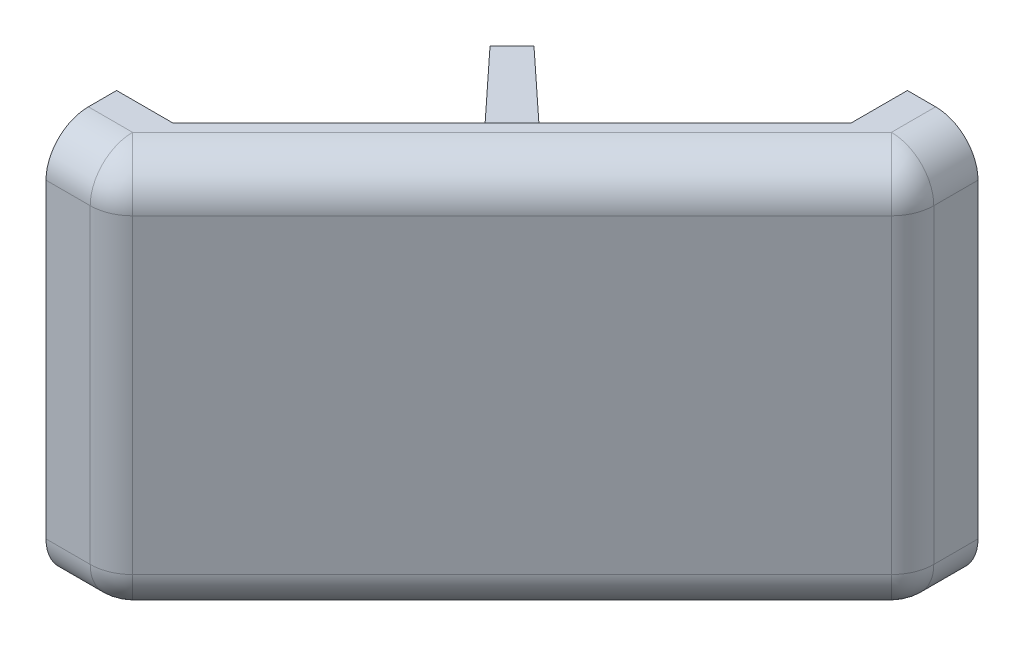
ISO-10303-21;
HEADER;
FILE_DESCRIPTION(('STEP AP214'),'2;1');
FILE_NAME('part.step','',(''),(''),'','','');
FILE_SCHEMA(('AUTOMOTIVE_DESIGN { 1 0 10303 214 1 1 1 1 }'));
ENDSEC;
DATA;
#1=APPLICATION_CONTEXT('core data for automotive mechanical design processes');
#2=APPLICATION_PROTOCOL_DEFINITION('international standard','automotive_design',2000,#1);
#3=PRODUCT_CONTEXT('',#1,'mechanical');
#4=PRODUCT('Part','Part','',(#3));
#5=PRODUCT_RELATED_PRODUCT_CATEGORY('part','',(#4));
#6=PRODUCT_DEFINITION_FORMATION('','',#4);
#7=PRODUCT_DEFINITION_CONTEXT('part definition',#1,'design');
#8=PRODUCT_DEFINITION('design','',#6,#7);
#9=PRODUCT_DEFINITION_SHAPE('','',#8);
#10=(LENGTH_UNIT() NAMED_UNIT(*) SI_UNIT(.MILLI.,.METRE.));
#11=(NAMED_UNIT(*) PLANE_ANGLE_UNIT() SI_UNIT($,.RADIAN.));
#12=(NAMED_UNIT(*) SI_UNIT($,.STERADIAN.) SOLID_ANGLE_UNIT());
#13=UNCERTAINTY_MEASURE_WITH_UNIT(LENGTH_MEASURE(1.E-05),#10,'distance_accuracy_value','');
#14=(GEOMETRIC_REPRESENTATION_CONTEXT(3) GLOBAL_UNCERTAINTY_ASSIGNED_CONTEXT((#13)) GLOBAL_UNIT_ASSIGNED_CONTEXT((#10,
#11,#12)) REPRESENTATION_CONTEXT('',''));
#15=CARTESIAN_POINT('',(0.,0.,0.));
#16=DIRECTION('',(0.,0.,1.));
#17=DIRECTION('',(1.,0.,0.));
#18=AXIS2_PLACEMENT_3D('',#15,#16,#17);
#19=CARTESIAN_POINT('',(-15.889087296526,9.25000000000002,12.110912703474));
#20=DIRECTION('',(0.426160307303989,-0.797981694625345,0.426160307303992));
#21=DIRECTION('',(0.,-0.47107876930948,-0.882091147844635));
#22=AXIS2_PLACEMENT_3D('',#19,#20,#21);
#23=PLANE('',#22);
#24=DIRECTION('',(-0.54434262878189,-0.602447824890011,-0.583736002638279));
#25=VECTOR('',#24,1.);
#26=CARTESIAN_POINT('',(-12.8461130269805,13.6022358518807,17.2174645182889));
#27=LINE('',#26,#25);
#28=CARTESIAN_POINT('',(-16.7785822082313,9.25000000000002,13.0004076151792));
#29=VERTEX_POINT('',#28);
#30=CARTESIAN_POINT('',(-19.8494455154673,5.85134109996337,9.70730989173632));
#31=VERTEX_POINT('',#30);
#32=EDGE_CURVE('E34',#29,#31,#27,.T.);
#33=ORIENTED_EDGE('',*,*,#32,.F.);
#34=DIRECTION('',(-0.707106781186548,0.,0.707106781186548));
#35=VECTOR('',#34,1.);
#36=CARTESIAN_POINT('',(-15.889087296526,9.25000000000002,12.110912703474));
#37=LINE('',#36,#35);
#38=CARTESIAN_POINT('',(-14.9995923848208,9.25000000000002,11.2214177917687));
#39=VERTEX_POINT('',#38);
#40=EDGE_CURVE('E25',#39,#29,#37,.T.);
#41=ORIENTED_EDGE('',*,*,#40,.F.);
#42=DIRECTION('',(0.583736002638279,0.602447824890011,0.544342628781889));
#43=VECTOR('',#42,1.);
#44=CARTESIAN_POINT('',(-15.0025813029042,9.24691527130424,11.2186305805648));
#45=LINE('',#44,#43);
#46=CARTESIAN_POINT('',(-18.2926901082637,5.85134109996337,8.15055448453267));
#47=VERTEX_POINT('',#46);
#48=EDGE_CURVE('E456',#47,#39,#45,.T.);
#49=ORIENTED_EDGE('',*,*,#48,.F.);
#50=DIRECTION('',(0.707106781186547,0.,-0.707106781186548));
#51=VECTOR('',#50,1.);
#52=CARTESIAN_POINT('',(-19.0710678118655,5.85134109996337,8.92893218813449));
#53=LINE('',#52,#51);
#54=EDGE_CURVE('E418',#31,#47,#53,.T.);
#55=ORIENTED_EDGE('',*,*,#54,.F.);
#56=EDGE_LOOP('',(#33,#41,#49,#55));
#57=FACE_BOUND('',#56,.T.);
#58=ADVANCED_FACE('F15',(#57),#23,.F.);
#59=CARTESIAN_POINT('',(-19.0710678118655,22.1486589000367,8.92893218813448));
#60=DIRECTION('',(0.426160307303993,0.797981694625344,0.42616030730399));
#61=DIRECTION('',(-0.882091147844634,0.471078769309481,0.));
#62=AXIS2_PLACEMENT_3D('',#59,#60,#61);
#63=PLANE('',#62);
#64=DIRECTION('',(0.544342628781888,-0.602447824890012,0.58373600263828));
#65=VECTOR('',#64,1.);
#66=CARTESIAN_POINT('',(-18.3156097025339,20.4510956367883,11.3521474238414));
#67=LINE('',#66,#65);
#68=CARTESIAN_POINT('',(-19.8494455154673,22.1486589000367,9.7073098917363));
#69=VERTEX_POINT('',#68);
#70=CARTESIAN_POINT('',(-16.7785822082313,18.75,13.0004076151792));
#71=VERTEX_POINT('',#70);
#72=EDGE_CURVE('E452',#69,#71,#67,.T.);
#73=ORIENTED_EDGE('',*,*,#72,.F.);
#74=DIRECTION('',(-0.707106781186547,0.,0.707106781186548));
#75=VECTOR('',#74,1.);
#76=CARTESIAN_POINT('',(-19.0710678118655,22.1486589000367,8.92893218813448));
#77=LINE('',#76,#75);
#78=CARTESIAN_POINT('',(-18.2926901082637,22.1486589000367,8.15055448453266));
#79=VERTEX_POINT('',#78);
#80=EDGE_CURVE('E459',#79,#69,#77,.T.);
#81=ORIENTED_EDGE('',*,*,#80,.F.);
#82=DIRECTION('',(-0.583736002638278,0.602447824890012,-0.544342628781889));
#83=VECTOR('',#82,1.);
#84=CARTESIAN_POINT('',(-12.4278067549655,16.0957750562119,13.6196466899208));
#85=LINE('',#84,#83);
#86=CARTESIAN_POINT('',(-14.9995923848208,18.75,11.2214177917687));
#87=VERTEX_POINT('',#86);
#88=EDGE_CURVE('E425',#87,#79,#85,.T.);
#89=ORIENTED_EDGE('',*,*,#88,.F.);
#90=DIRECTION('',(-0.707106781186548,0.,0.707106781186548));
#91=VECTOR('',#90,1.);
#92=CARTESIAN_POINT('',(-15.889087296526,18.75,12.110912703474));
#93=LINE('',#92,#91);
#94=EDGE_CURVE('E9',#87,#71,#93,.T.);
#95=ORIENTED_EDGE('',*,*,#94,.T.);
#96=EDGE_LOOP('',(#73,#81,#89,#95));
#97=FACE_BOUND('',#96,.T.);
#98=ADVANCED_FACE('F369',(#97),#63,.F.);
#99=CARTESIAN_POINT('',(-15.889087296526,18.75,12.110912703474));
#100=DIRECTION('',(0.707106781186548,0.,0.707106781186548));
#101=DIRECTION('',(0.707106781186548,0.,-0.707106781186548));
#102=AXIS2_PLACEMENT_3D('',#99,#100,#101);
#103=PLANE('',#102);
#104=DIRECTION('',(0.,-1.,0.));
#105=VECTOR('',#104,1.);
#106=CARTESIAN_POINT('',(-16.7785822082312,22.375,13.0004076151792));
#107=LINE('',#106,#105);
#108=EDGE_CURVE('E413',#71,#29,#107,.T.);
#109=ORIENTED_EDGE('',*,*,#108,.F.);
#110=ORIENTED_EDGE('',*,*,#94,.F.);
#111=DIRECTION('',(0.,1.,0.));
#112=VECTOR('',#111,1.);
#113=CARTESIAN_POINT('',(-14.9995923848208,10.375,11.2214177917687));
#114=LINE('',#113,#112);
#115=EDGE_CURVE('E453',#39,#87,#114,.T.);
#116=ORIENTED_EDGE('',*,*,#115,.F.);
#117=ORIENTED_EDGE('',*,*,#40,.T.);
#118=EDGE_LOOP('',(#109,#110,#116,#117));
#119=FACE_BOUND('',#118,.T.);
#120=ADVANCED_FACE('F374',(#119),#103,.F.);
#121=CARTESIAN_POINT('',(-19.0710678118655,14.,8.92893218813449));
#122=DIRECTION('',(0.707106781186548,0.,0.707106781186547));
#123=DIRECTION('',(0.707106781186547,0.,-0.707106781186548));
#124=AXIS2_PLACEMENT_3D('',#121,#122,#123);
#125=PLANE('',#124);
#126=ORIENTED_EDGE('',*,*,#80,.T.);
#127=DIRECTION('',(0.,-1.,0.));
#128=VECTOR('',#127,1.);
#129=CARTESIAN_POINT('',(-19.8494455154673,26.,9.7073098917363));
#130=LINE('',#129,#128);
#131=CARTESIAN_POINT('',(-19.8494455154673,25.6507923050826,9.7073098917363));
#132=VERTEX_POINT('',#131);
#133=EDGE_CURVE('E439',#132,#69,#130,.T.);
#134=ORIENTED_EDGE('',*,*,#133,.F.);
#135=DIRECTION('',(-0.707106781186548,0.,0.707106781186547));
#136=VECTOR('',#135,1.);
#137=CARTESIAN_POINT('',(-18.045762979145,25.6507923050826,7.903627355414));
#138=LINE('',#137,#136);
#139=CARTESIAN_POINT('',(-18.2926901082637,25.6507923050826,8.15055448453266));
#140=VERTEX_POINT('',#139);
#141=EDGE_CURVE('E431',#140,#132,#138,.T.);
#142=ORIENTED_EDGE('',*,*,#141,.F.);
#143=DIRECTION('',(0.,1.,0.));
#144=VECTOR('',#143,1.);
#145=CARTESIAN_POINT('',(-18.2926901082637,2.00000000000002,8.15055448453267));
#146=LINE('',#145,#144);
#147=EDGE_CURVE('E422',#79,#140,#146,.T.);
#148=ORIENTED_EDGE('',*,*,#147,.F.);
#149=EDGE_LOOP('',(#126,#134,#142,#148));
#150=FACE_BOUND('',#149,.T.);
#151=ADVANCED_FACE('F380',(#150),#125,.F.);
#152=CARTESIAN_POINT('',(-19.0710678118655,14.,8.92893218813449));
#153=DIRECTION('',(0.707106781186548,0.,0.707106781186547));
#154=DIRECTION('',(0.707106781186547,0.,-0.707106781186548));
#155=AXIS2_PLACEMENT_3D('',#152,#153,#154);
#156=PLANE('',#155);
#157=ORIENTED_EDGE('',*,*,#54,.T.);
#158=DIRECTION('',(0.,1.,0.));
#159=VECTOR('',#158,1.);
#160=CARTESIAN_POINT('',(-18.2926901082637,2.00000000000002,8.15055448453267));
#161=LINE('',#160,#159);
#162=CARTESIAN_POINT('',(-18.2926901082637,2.3492076949175,8.15055448453267));
#163=VERTEX_POINT('',#162);
#164=EDGE_CURVE('E417',#163,#47,#161,.T.);
#165=ORIENTED_EDGE('',*,*,#164,.F.);
#166=DIRECTION('',(0.707106781186548,0.,-0.707106781186547));
#167=VECTOR('',#166,1.);
#168=CARTESIAN_POINT('',(-20.096372644586,2.3492076949175,9.954237020855));
#169=LINE('',#168,#167);
#170=CARTESIAN_POINT('',(-19.8494455154673,2.3492076949175,9.70730989173632));
#171=VERTEX_POINT('',#170);
#172=EDGE_CURVE('E403',#171,#163,#169,.T.);
#173=ORIENTED_EDGE('',*,*,#172,.F.);
#174=DIRECTION('',(0.,-1.,0.));
#175=VECTOR('',#174,1.);
#176=CARTESIAN_POINT('',(-19.8494455154673,26.,9.7073098917363));
#177=LINE('',#176,#175);
#178=EDGE_CURVE('E438',#31,#171,#177,.T.);
#179=ORIENTED_EDGE('',*,*,#178,.F.);
#180=EDGE_LOOP('',(#157,#165,#173,#179));
#181=FACE_BOUND('',#180,.T.);
#182=ADVANCED_FACE('F384',(#181),#156,.F.);
#183=CARTESIAN_POINT('',(-10.9746951672795,2.00000000000001,14.9746951672795));
#184=DIRECTION('',(0.681998360062499,0.,-0.73135370161917));
#185=DIRECTION('',(-0.73135370161917,0.,-0.681998360062499));
#186=AXIS2_PLACEMENT_3D('',#183,#184,#185);
#187=PLANE('',#186);
#188=ORIENTED_EDGE('',*,*,#48,.T.);
#189=ORIENTED_EDGE('',*,*,#115,.T.);
#190=ORIENTED_EDGE('',*,*,#88,.T.);
#191=ORIENTED_EDGE('',*,*,#147,.T.);
#192=DIRECTION('',(-0.730908722842805,-0.0348782627423742,-0.681583410640527));
#193=VECTOR('',#192,1.);
#194=CARTESIAN_POINT('',(-11.2806090849916,25.9854020814569,14.6894258239535));
#195=LINE('',#194,#193);
#196=CARTESIAN_POINT('',(-10.9746951672795,26.,14.9746951672795));
#197=VERTEX_POINT('',#196);
#198=EDGE_CURVE('E434',#197,#140,#195,.T.);
#199=ORIENTED_EDGE('',*,*,#198,.F.);
#200=DIRECTION('',(0.,1.,0.));
#201=VECTOR('',#200,1.);
#202=CARTESIAN_POINT('',(-10.9746951672795,1.00000000000001,14.9746951672795));
#203=LINE('',#202,#201);
#204=CARTESIAN_POINT('',(-10.9746951672795,2.00000000000001,14.9746951672795));
#205=VERTEX_POINT('',#204);
#206=EDGE_CURVE('E421',#205,#197,#203,.T.);
#207=ORIENTED_EDGE('',*,*,#206,.F.);
#208=DIRECTION('',(-0.730908722842805,0.0348782627423751,-0.681583410640527));
#209=VECTOR('',#208,1.);
#210=CARTESIAN_POINT('',(-11.0116597656697,2.00176391515731,14.9402251216276));
#211=LINE('',#210,#209);
#212=EDGE_CURVE('E407',#205,#163,#211,.T.);
#213=ORIENTED_EDGE('',*,*,#212,.T.);
#214=ORIENTED_EDGE('',*,*,#164,.T.);
#215=EDGE_LOOP('',(#188,#189,#190,#191,#199,#207,#213,#214));
#216=FACE_BOUND('',#215,.T.);
#217=ADVANCED_FACE('F388',(#216),#187,.T.);
#218=CARTESIAN_POINT('',(-13.0253048327205,26.,17.0253048327205));
#219=DIRECTION('',(-0.731353701619171,0.,0.681998360062498));
#220=DIRECTION('',(0.681998360062498,0.,0.731353701619171));
#221=AXIS2_PLACEMENT_3D('',#218,#219,#220);
#222=PLANE('',#221);
#223=ORIENTED_EDGE('',*,*,#32,.T.);
#224=ORIENTED_EDGE('',*,*,#178,.T.);
#225=DIRECTION('',(-0.681583410640527,0.034878262742375,-0.730908722842806));
#226=VECTOR('',#225,1.);
#227=CARTESIAN_POINT('',(-13.3105741760465,2.01459791854313,16.7193909150084));
#228=LINE('',#227,#226);
#229=CARTESIAN_POINT('',(-13.0253048327205,2.00000000000002,17.0253048327205));
#230=VERTEX_POINT('',#229);
#231=EDGE_CURVE('E410',#230,#171,#228,.T.);
#232=ORIENTED_EDGE('',*,*,#231,.F.);
#233=DIRECTION('',(0.,-1.,0.));
#234=VECTOR('',#233,1.);
#235=CARTESIAN_POINT('',(-13.0253048327205,13.,17.0253048327205));
#236=LINE('',#235,#234);
#237=CARTESIAN_POINT('',(-13.0253048327205,26.,17.0253048327205));
#238=VERTEX_POINT('',#237);
#239=EDGE_CURVE('E432',#238,#230,#236,.T.);
#240=ORIENTED_EDGE('',*,*,#239,.F.);
#241=DIRECTION('',(-0.681583410640527,-0.0348782627423743,-0.730908722842806));
#242=VECTOR('',#241,1.);
#243=CARTESIAN_POINT('',(-13.0597748783724,25.9982360848427,16.9883402343302));
#244=LINE('',#243,#242);
#245=EDGE_CURVE('E436',#238,#132,#244,.T.);
#246=ORIENTED_EDGE('',*,*,#245,.T.);
#247=ORIENTED_EDGE('',*,*,#133,.T.);
#248=ORIENTED_EDGE('',*,*,#72,.T.);
#249=ORIENTED_EDGE('',*,*,#108,.T.);
#250=EDGE_LOOP('',(#223,#224,#232,#240,#246,#247,#248,#249));
#251=FACE_BOUND('',#250,.T.);
#252=ADVANCED_FACE('F392',(#251),#222,.T.);
#253=CARTESIAN_POINT('',(-13.0253048327205,2.00000000000002,17.0253048327205));
#254=DIRECTION('',(-0.0246776707783373,-0.999390827019096,-0.0246776707783353));
#255=DIRECTION('',(0.999695274307761,-0.0246851884078331,0.));
#256=AXIS2_PLACEMENT_3D('',#253,#254,#255);
#257=PLANE('',#256);
#258=ORIENTED_EDGE('',*,*,#172,.T.);
#259=ORIENTED_EDGE('',*,*,#212,.F.);
#260=DIRECTION('',(0.707106781186548,0.,-0.707106781186547));
#261=VECTOR('',#260,1.);
#262=CARTESIAN_POINT('',(-6.51265241636029,2.,10.5126524163602));
#263=LINE('',#262,#261);
#264=EDGE_CURVE('E435',#230,#205,#263,.T.);
#265=ORIENTED_EDGE('',*,*,#264,.F.);
#266=ORIENTED_EDGE('',*,*,#231,.T.);
#267=EDGE_LOOP('',(#258,#259,#265,#266));
#268=FACE_BOUND('',#267,.T.);
#269=ADVANCED_FACE('F365',(#268),#257,.T.);
#270=CARTESIAN_POINT('',(-10.9746951672795,26.,14.9746951672795));
#271=DIRECTION('',(-0.0246776707783347,0.999390827019096,-0.0246776707783367));
#272=DIRECTION('',(0.,0.0246851884078325,0.999695274307761));
#273=AXIS2_PLACEMENT_3D('',#270,#271,#272);
#274=PLANE('',#273);
#275=ORIENTED_EDGE('',*,*,#141,.T.);
#276=ORIENTED_EDGE('',*,*,#245,.F.);
#277=DIRECTION('',(-0.707106781186548,0.,0.707106781186547));
#278=VECTOR('',#277,1.);
#279=CARTESIAN_POINT('',(-5.48734758363976,26.,9.48734758363973));
#280=LINE('',#279,#278);
#281=EDGE_CURVE('E203',#197,#238,#280,.T.);
#282=ORIENTED_EDGE('',*,*,#281,.F.);
#283=ORIENTED_EDGE('',*,*,#198,.T.);
#284=EDGE_LOOP('',(#275,#276,#282,#283));
#285=FACE_BOUND('',#284,.T.);
#286=ADVANCED_FACE('F356',(#285),#274,.T.);
#287=CARTESIAN_POINT('',(0.,0.,4.));
#288=DIRECTION('',(0.707106781186547,0.,0.707106781186548));
#289=DIRECTION('',(0.707106781186548,0.,-0.707106781186547));
#290=AXIS2_PLACEMENT_3D('',#287,#288,#289);
#291=PLANE('',#290);
#292=ORIENTED_EDGE('',*,*,#239,.T.);
#293=ORIENTED_EDGE('',*,*,#264,.T.);
#294=ORIENTED_EDGE('',*,*,#206,.T.);
#295=ORIENTED_EDGE('',*,*,#281,.T.);
#296=EDGE_LOOP('',(#292,#293,#294,#295));
#297=FACE_BOUND('',#296,.T.);
#298=DIRECTION('',(0.,1.,0.));
#299=VECTOR('',#298,1.);
#300=CARTESIAN_POINT('',(0.,0.,4.));
#301=LINE('',#300,#299);
#302=CARTESIAN_POINT('',(0.,0.,4.));
#303=VERTEX_POINT('',#302);
#304=CARTESIAN_POINT('',(0.,28.,3.99999999999999));
#305=VERTEX_POINT('',#304);
#306=EDGE_CURVE('E188',#303,#305,#301,.T.);
#307=ORIENTED_EDGE('',*,*,#306,.F.);
#308=DIRECTION('',(0.707106781186548,0.,-0.707106781186547));
#309=VECTOR('',#308,1.);
#310=CARTESIAN_POINT('',(-24.,0.,28.));
#311=LINE('',#310,#309);
#312=CARTESIAN_POINT('',(-24.,0.,28.));
#313=VERTEX_POINT('',#312);
#314=EDGE_CURVE('E205',#313,#303,#311,.T.);
#315=ORIENTED_EDGE('',*,*,#314,.F.);
#316=DIRECTION('',(0.,1.,0.));
#317=VECTOR('',#316,1.);
#318=CARTESIAN_POINT('',(-24.,0.,28.));
#319=LINE('',#318,#317);
#320=CARTESIAN_POINT('',(-24.,28.,28.));
#321=VERTEX_POINT('',#320);
#322=EDGE_CURVE('E210',#313,#321,#319,.T.);
#323=ORIENTED_EDGE('',*,*,#322,.T.);
#324=DIRECTION('',(-0.707106781186548,0.,0.707106781186547));
#325=VECTOR('',#324,1.);
#326=CARTESIAN_POINT('',(0.,28.,3.99999999999998));
#327=LINE('',#326,#325);
#328=EDGE_CURVE('E191',#305,#321,#327,.T.);
#329=ORIENTED_EDGE('',*,*,#328,.F.);
#330=EDGE_LOOP('',(#307,#315,#323,#329));
#331=FACE_BOUND('',#330,.T.);
#332=ADVANCED_FACE('F354',(#297,#331),#291,.F.);
#333=CARTESIAN_POINT('',(-11.5,0.,16.5));
#334=DIRECTION('',(0.,1.,0.));
#335=DIRECTION('',(0.,0.,1.));
#336=AXIS2_PLACEMENT_3D('',#333,#334,#335);
#337=PLANE('',#336);
#338=DIRECTION('',(0.707106781186548,0.,-0.707106781186547));
#339=VECTOR('',#338,1.);
#340=CARTESIAN_POINT('',(-24.8686291501016,0.,30.));
#341=LINE('',#340,#339);
#342=CARTESIAN_POINT('',(-24.8686291501016,0.,30.));
#343=VERTEX_POINT('',#342);
#344=CARTESIAN_POINT('',(2.,0.,3.13137084989849));
#345=VERTEX_POINT('',#344);
#346=EDGE_CURVE('E215',#343,#345,#341,.T.);
#347=ORIENTED_EDGE('',*,*,#346,.F.);
#348=DIRECTION('',(1.,0.,0.));
#349=VECTOR('',#348,1.);
#350=CARTESIAN_POINT('',(-28.,0.,30.));
#351=LINE('',#350,#349);
#352=CARTESIAN_POINT('',(-28.,0.,30.));
#353=VERTEX_POINT('',#352);
#354=EDGE_CURVE('E221',#353,#343,#351,.T.);
#355=ORIENTED_EDGE('',*,*,#354,.F.);
#356=DIRECTION('',(0.,0.,-1.));
#357=VECTOR('',#356,1.);
#358=CARTESIAN_POINT('',(-28.,0.,30.));
#359=LINE('',#358,#357);
#360=CARTESIAN_POINT('',(-28.,0.,28.));
#361=VERTEX_POINT('',#360);
#362=EDGE_CURVE('E213',#353,#361,#359,.T.);
#363=ORIENTED_EDGE('',*,*,#362,.T.);
#364=DIRECTION('',(1.,0.,0.));
#365=VECTOR('',#364,1.);
#366=CARTESIAN_POINT('',(-28.,0.,28.));
#367=LINE('',#366,#365);
#368=EDGE_CURVE('E208',#361,#313,#367,.T.);
#369=ORIENTED_EDGE('',*,*,#368,.T.);
#370=ORIENTED_EDGE('',*,*,#314,.T.);
#371=DIRECTION('',(0.,0.,-1.));
#372=VECTOR('',#371,1.);
#373=CARTESIAN_POINT('',(0.,0.,4.));
#374=LINE('',#373,#372);
#375=CARTESIAN_POINT('',(0.,0.,0.));
#376=VERTEX_POINT('',#375);
#377=EDGE_CURVE('E209',#303,#376,#374,.T.);
#378=ORIENTED_EDGE('',*,*,#377,.T.);
#379=DIRECTION('',(1.,0.,0.));
#380=VECTOR('',#379,1.);
#381=CARTESIAN_POINT('',(0.,0.,0.));
#382=LINE('',#381,#380);
#383=CARTESIAN_POINT('',(1.99999999999999,0.,0.));
#384=VERTEX_POINT('',#383);
#385=EDGE_CURVE('E196',#376,#384,#382,.T.);
#386=ORIENTED_EDGE('',*,*,#385,.T.);
#387=DIRECTION('',(0.,0.,-1.));
#388=VECTOR('',#387,1.);
#389=CARTESIAN_POINT('',(1.99999999999999,0.,3.13137084989849));
#390=LINE('',#389,#388);
#391=EDGE_CURVE('E190',#345,#384,#390,.T.);
#392=ORIENTED_EDGE('',*,*,#391,.F.);
#393=EDGE_LOOP('',(#347,#355,#363,#369,#370,#378,#386,#392));
#394=FACE_BOUND('',#393,.T.);
#395=ADVANCED_FACE('F352',(#394),#337,.F.);
#396=CARTESIAN_POINT('',(2.,25.,3.13137084989849));
#397=DIRECTION('',(0.,0.,1.));
#398=DIRECTION('',(1.,0.,0.));
#399=AXIS2_PLACEMENT_3D('',#396,#397,#398);
#400=SPHERICAL_SURFACE('',#399,3.);
#401=CARTESIAN_POINT('',(2.,25.,3.13137084989849));
#402=DIRECTION('',(0.,1.,0.));
#403=DIRECTION('',(1.,0.,0.));
#404=AXIS2_PLACEMENT_3D('',#401,#402,#403);
#405=CIRCLE('',#404,3.);
#406=CARTESIAN_POINT('',(4.12132034355963,25.,5.25269119345813));
#407=VERTEX_POINT('',#406);
#408=CARTESIAN_POINT('',(4.99999999999997,25.,3.1313708498985));
#409=VERTEX_POINT('',#408);
#410=EDGE_CURVE('E235',#407,#409,#405,.T.);
#411=ORIENTED_EDGE('',*,*,#410,.T.);
#412=CARTESIAN_POINT('',(1.99999999999999,25.,3.13137084989849));
#413=DIRECTION('',(0.,0.,-1.));
#414=DIRECTION('',(0.,-1.,0.));
#415=AXIS2_PLACEMENT_3D('',#412,#413,#414);
#416=CIRCLE('',#415,3.);
#417=CARTESIAN_POINT('',(2.,28.,3.13137084989849));
#418=VERTEX_POINT('',#417);
#419=EDGE_CURVE('E241',#418,#409,#416,.T.);
#420=ORIENTED_EDGE('',*,*,#419,.F.);
#421=CARTESIAN_POINT('',(2.,25.,3.13137084989849));
#422=DIRECTION('',(-0.707106781186549,0.,0.707106781186546));
#423=DIRECTION('',(0.,1.,0.));
#424=AXIS2_PLACEMENT_3D('',#421,#422,#423);
#425=CIRCLE('',#424,3.);
#426=EDGE_CURVE('E245',#407,#418,#425,.T.);
#427=ORIENTED_EDGE('',*,*,#426,.F.);
#428=EDGE_LOOP('',(#411,#420,#427));
#429=FACE_BOUND('',#428,.T.);
#430=ADVANCED_FACE('F342',(#429),#400,.T.);
#431=CARTESIAN_POINT('',(1.99999999999999,25.,16.5));
#432=DIRECTION('',(0.,0.,1.));
#433=DIRECTION('',(1.,0.,0.));
#434=AXIS2_PLACEMENT_3D('',#431,#432,#433);
#435=CYLINDRICAL_SURFACE('',#434,3.);
#436=CARTESIAN_POINT('',(1.99999999999997,25.,0.));
#437=DIRECTION('',(0.,0.,1.));
#438=DIRECTION('',(1.,0.,0.));
#439=AXIS2_PLACEMENT_3D('',#436,#437,#438);
#440=CIRCLE('',#439,3.);
#441=CARTESIAN_POINT('',(4.99999999999997,25.,0.));
#442=VERTEX_POINT('',#441);
#443=CARTESIAN_POINT('',(1.99999999999997,28.,0.));
#444=VERTEX_POINT('',#443);
#445=EDGE_CURVE('E240',#442,#444,#440,.T.);
#446=ORIENTED_EDGE('',*,*,#445,.T.);
#447=DIRECTION('',(0.,0.,1.));
#448=VECTOR('',#447,1.);
#449=CARTESIAN_POINT('',(2.,28.,0.));
#450=LINE('',#449,#448);
#451=EDGE_CURVE('E178',#444,#418,#450,.T.);
#452=ORIENTED_EDGE('',*,*,#451,.T.);
#453=ORIENTED_EDGE('',*,*,#419,.T.);
#454=DIRECTION('',(0.,0.,-1.));
#455=VECTOR('',#454,1.);
#456=CARTESIAN_POINT('',(5.,25.,3.1313708498985));
#457=LINE('',#456,#455);
#458=EDGE_CURVE('E244',#409,#442,#457,.T.);
#459=ORIENTED_EDGE('',*,*,#458,.T.);
#460=EDGE_LOOP('',(#446,#452,#453,#459));
#461=FACE_BOUND('',#460,.T.);
#462=ADVANCED_FACE('F344',(#461),#435,.T.);
#463=CARTESIAN_POINT('',(-24.8686291501016,25.,30.));
#464=DIRECTION('',(1.,0.,0.));
#465=DIRECTION('',(0.,-1.,0.));
#466=AXIS2_PLACEMENT_3D('',#463,#464,#465);
#467=SPHERICAL_SURFACE('',#466,3.);
#468=CARTESIAN_POINT('',(-24.8686291501016,25.,30.));
#469=DIRECTION('',(0.,1.,0.));
#470=DIRECTION('',(1.,0.,0.));
#471=AXIS2_PLACEMENT_3D('',#468,#469,#470);
#472=CIRCLE('',#471,3.);
#473=CARTESIAN_POINT('',(-24.8686291501016,25.,33.));
#474=VERTEX_POINT('',#473);
#475=CARTESIAN_POINT('',(-22.7473088065419,25.,32.1213203435596));
#476=VERTEX_POINT('',#475);
#477=EDGE_CURVE('E252',#474,#476,#472,.T.);
#478=ORIENTED_EDGE('',*,*,#477,.T.);
#479=CARTESIAN_POINT('',(-24.8686291501016,25.,30.));
#480=DIRECTION('',(0.707106781186548,0.,-0.707106781186547));
#481=DIRECTION('',(0.,-1.,0.));
#482=AXIS2_PLACEMENT_3D('',#479,#480,#481);
#483=CIRCLE('',#482,3.);
#484=CARTESIAN_POINT('',(-24.8686291501016,28.,30.));
#485=VERTEX_POINT('',#484);
#486=EDGE_CURVE('E256',#485,#476,#483,.T.);
#487=ORIENTED_EDGE('',*,*,#486,.F.);
#488=CARTESIAN_POINT('',(-24.8686291501016,25.,30.));
#489=DIRECTION('',(-1.,0.,0.));
#490=DIRECTION('',(0.,0.,1.));
#491=AXIS2_PLACEMENT_3D('',#488,#489,#490);
#492=CIRCLE('',#491,3.);
#493=EDGE_CURVE('E259',#474,#485,#492,.T.);
#494=ORIENTED_EDGE('',*,*,#493,.F.);
#495=EDGE_LOOP('',(#478,#487,#494));
#496=FACE_BOUND('',#495,.T.);
#497=ADVANCED_FACE('F508',(#496),#467,.T.);
#498=CARTESIAN_POINT('',(-28.826709304064,25.,33.9580801539624));
#499=DIRECTION('',(0.707106781186548,0.,-0.707106781186547));
#500=DIRECTION('',(0.,-1.,0.));
#501=AXIS2_PLACEMENT_3D('',#498,#499,#500);
#502=CYLINDRICAL_SURFACE('',#501,3.);
#503=DIRECTION('',(-0.707106781186548,0.,0.707106781186547));
#504=VECTOR('',#503,1.);
#505=CARTESIAN_POINT('',(2.,28.,3.13137084989849));
#506=LINE('',#505,#504);
#507=EDGE_CURVE('E255',#418,#485,#506,.T.);
#508=ORIENTED_EDGE('',*,*,#507,.T.);
#509=ORIENTED_EDGE('',*,*,#486,.T.);
#510=DIRECTION('',(0.707106781186548,0.,-0.707106781186547));
#511=VECTOR('',#510,1.);
#512=CARTESIAN_POINT('',(-22.7473088065419,25.,32.1213203435596));
#513=LINE('',#512,#511);
#514=EDGE_CURVE('E247',#476,#407,#513,.T.);
#515=ORIENTED_EDGE('',*,*,#514,.T.);
#516=ORIENTED_EDGE('',*,*,#426,.T.);
#517=EDGE_LOOP('',(#508,#509,#515,#516));
#518=FACE_BOUND('',#517,.T.);
#519=ADVANCED_FACE('F338',(#518),#502,.T.);
#520=CARTESIAN_POINT('',(-11.5,25.,30.));
#521=DIRECTION('',(-1.,0.,0.));
#522=DIRECTION('',(0.,0.,1.));
#523=AXIS2_PLACEMENT_3D('',#520,#521,#522);
#524=CYLINDRICAL_SURFACE('',#523,3.);
#525=CARTESIAN_POINT('',(-28.,25.,30.));
#526=DIRECTION('',(1.,0.,0.));
#527=DIRECTION('',(0.,1.,0.));
#528=AXIS2_PLACEMENT_3D('',#525,#526,#527);
#529=CIRCLE('',#528,3.);
#530=CARTESIAN_POINT('',(-28.,28.,30.));
#531=VERTEX_POINT('',#530);
#532=CARTESIAN_POINT('',(-28.,25.,33.));
#533=VERTEX_POINT('',#532);
#534=EDGE_CURVE('E248',#531,#533,#529,.T.);
#535=ORIENTED_EDGE('',*,*,#534,.T.);
#536=DIRECTION('',(1.,0.,0.));
#537=VECTOR('',#536,1.);
#538=CARTESIAN_POINT('',(-28.,25.,33.));
#539=LINE('',#538,#537);
#540=EDGE_CURVE('E261',#533,#474,#539,.T.);
#541=ORIENTED_EDGE('',*,*,#540,.T.);
#542=ORIENTED_EDGE('',*,*,#493,.T.);
#543=DIRECTION('',(-1.,0.,0.));
#544=VECTOR('',#543,1.);
#545=CARTESIAN_POINT('',(-24.8686291501016,28.,30.));
#546=LINE('',#545,#544);
#547=EDGE_CURVE('E262',#485,#531,#546,.T.);
#548=ORIENTED_EDGE('',*,*,#547,.T.);
#549=EDGE_LOOP('',(#535,#541,#542,#548));
#550=FACE_BOUND('',#549,.T.);
#551=ADVANCED_FACE('F334',(#550),#524,.T.);
#552=CARTESIAN_POINT('',(2.,0.,3.13137084989849));
#553=DIRECTION('',(0.,-1.,0.));
#554=DIRECTION('',(0.,0.,-1.));
#555=AXIS2_PLACEMENT_3D('',#552,#553,#554);
#556=CYLINDRICAL_SURFACE('',#555,3.);
#557=ORIENTED_EDGE('',*,*,#410,.F.);
#558=DIRECTION('',(0.,-1.,0.));
#559=VECTOR('',#558,1.);
#560=CARTESIAN_POINT('',(4.12132034355965,25.,5.25269119345814));
#561=LINE('',#560,#559);
#562=CARTESIAN_POINT('',(4.12132034355965,3.00000000000003,5.25269119345815));
#563=VERTEX_POINT('',#562);
#564=EDGE_CURVE('E272',#407,#563,#561,.T.);
#565=ORIENTED_EDGE('',*,*,#564,.T.);
#566=CARTESIAN_POINT('',(2.,3.00000000000003,3.13137084989849));
#567=DIRECTION('',(0.,-1.,0.));
#568=DIRECTION('',(0.,0.,-1.));
#569=AXIS2_PLACEMENT_3D('',#566,#567,#568);
#570=CIRCLE('',#569,3.);
#571=CARTESIAN_POINT('',(4.99999999999999,3.00000000000003,3.1313708498985));
#572=VERTEX_POINT('',#571);
#573=EDGE_CURVE('E219',#572,#563,#570,.T.);
#574=ORIENTED_EDGE('',*,*,#573,.F.);
#575=DIRECTION('',(0.,1.,0.));
#576=VECTOR('',#575,1.);
#577=CARTESIAN_POINT('',(4.99999999999999,3.00000000000003,3.1313708498985));
#578=LINE('',#577,#576);
#579=EDGE_CURVE('E275',#572,#409,#578,.T.);
#580=ORIENTED_EDGE('',*,*,#579,.T.);
#581=EDGE_LOOP('',(#557,#565,#574,#580));
#582=FACE_BOUND('',#581,.T.);
#583=ADVANCED_FACE('F534',(#582),#556,.T.);
#584=CARTESIAN_POINT('',(-27.5977836895176,0.,36.9717952265353));
#585=DIRECTION('',(-0.707106781186547,0.,-0.707106781186548));
#586=DIRECTION('',(-0.707106781186548,0.,0.707106781186547));
#587=AXIS2_PLACEMENT_3D('',#584,#585,#586);
#588=PLANE('',#587);
#589=ORIENTED_EDGE('',*,*,#514,.F.);
#590=DIRECTION('',(0.,1.,0.));
#591=VECTOR('',#590,1.);
#592=CARTESIAN_POINT('',(-22.7473088065419,3.00000000000004,32.1213203435596));
#593=LINE('',#592,#591);
#594=CARTESIAN_POINT('',(-22.7473088065419,3.00000000000004,32.1213203435596));
#595=VERTEX_POINT('',#594);
#596=EDGE_CURVE('E282',#595,#476,#593,.T.);
#597=ORIENTED_EDGE('',*,*,#596,.F.);
#598=DIRECTION('',(-0.707106781186548,0.,0.707106781186547));
#599=VECTOR('',#598,1.);
#600=CARTESIAN_POINT('',(4.12132034355963,3.00000000000003,5.25269119345813));
#601=LINE('',#600,#599);
#602=EDGE_CURVE('E286',#563,#595,#601,.T.);
#603=ORIENTED_EDGE('',*,*,#602,.F.);
#604=ORIENTED_EDGE('',*,*,#564,.F.);
#605=EDGE_LOOP('',(#589,#597,#603,#604));
#606=FACE_BOUND('',#605,.T.);
#607=ADVANCED_FACE('F543',(#606),#588,.F.);
#608=CARTESIAN_POINT('',(-24.8686291501016,0.,30.));
#609=DIRECTION('',(0.,1.,0.));
#610=DIRECTION('',(1.,0.,0.));
#611=AXIS2_PLACEMENT_3D('',#608,#609,#610);
#612=CYLINDRICAL_SURFACE('',#611,3.);
#613=ORIENTED_EDGE('',*,*,#477,.F.);
#614=DIRECTION('',(0.,-1.,0.));
#615=VECTOR('',#614,1.);
#616=CARTESIAN_POINT('',(-24.8686291501016,25.,33.));
#617=LINE('',#616,#615);
#618=CARTESIAN_POINT('',(-24.8686291501016,3.00000000000004,33.));
#619=VERTEX_POINT('',#618);
#620=EDGE_CURVE('E281',#474,#619,#617,.T.);
#621=ORIENTED_EDGE('',*,*,#620,.T.);
#622=CARTESIAN_POINT('',(-24.8686291501016,3.00000000000004,30.));
#623=DIRECTION('',(0.,-1.,0.));
#624=DIRECTION('',(0.,0.,-1.));
#625=AXIS2_PLACEMENT_3D('',#622,#623,#624);
#626=CIRCLE('',#625,3.);
#627=EDGE_CURVE('E291',#595,#619,#626,.T.);
#628=ORIENTED_EDGE('',*,*,#627,.F.);
#629=ORIENTED_EDGE('',*,*,#596,.T.);
#630=EDGE_LOOP('',(#613,#621,#628,#629));
#631=FACE_BOUND('',#630,.T.);
#632=ADVANCED_FACE('F552',(#631),#612,.T.);
#633=CARTESIAN_POINT('',(4.99999999999997,0.,33.));
#634=DIRECTION('',(0.,0.,1.));
#635=DIRECTION('',(1.,0.,0.));
#636=AXIS2_PLACEMENT_3D('',#633,#634,#635);
#637=PLANE('',#636);
#638=ORIENTED_EDGE('',*,*,#540,.F.);
#639=DIRECTION('',(0.,1.,0.));
#640=VECTOR('',#639,1.);
#641=CARTESIAN_POINT('',(-28.,3.00000000000004,33.));
#642=LINE('',#641,#640);
#643=CARTESIAN_POINT('',(-28.,3.00000000000004,33.));
#644=VERTEX_POINT('',#643);
#645=EDGE_CURVE('E294',#644,#533,#642,.T.);
#646=ORIENTED_EDGE('',*,*,#645,.F.);
#647=DIRECTION('',(-1.,0.,0.));
#648=VECTOR('',#647,1.);
#649=CARTESIAN_POINT('',(-24.8686291501016,3.00000000000004,33.));
#650=LINE('',#649,#648);
#651=EDGE_CURVE('E278',#619,#644,#650,.T.);
#652=ORIENTED_EDGE('',*,*,#651,.F.);
#653=ORIENTED_EDGE('',*,*,#620,.F.);
#654=EDGE_LOOP('',(#638,#646,#652,#653));
#655=FACE_BOUND('',#654,.T.);
#656=ADVANCED_FACE('F562',(#655),#637,.T.);
#657=CARTESIAN_POINT('',(-28.,0.,33.));
#658=DIRECTION('',(-1.,0.,0.));
#659=DIRECTION('',(0.,0.,1.));
#660=AXIS2_PLACEMENT_3D('',#657,#658,#659);
#661=PLANE('',#660);
#662=ORIENTED_EDGE('',*,*,#534,.F.);
#663=DIRECTION('',(0.,0.,-1.));
#664=VECTOR('',#663,1.);
#665=CARTESIAN_POINT('',(-28.,28.,30.));
#666=LINE('',#665,#664);
#667=CARTESIAN_POINT('',(-28.,28.,28.));
#668=VERTEX_POINT('',#667);
#669=EDGE_CURVE('E285',#531,#668,#666,.T.);
#670=ORIENTED_EDGE('',*,*,#669,.T.);
#671=DIRECTION('',(0.,-1.,0.));
#672=VECTOR('',#671,1.);
#673=CARTESIAN_POINT('',(-28.,28.,28.));
#674=LINE('',#673,#672);
#675=EDGE_CURVE('E297',#668,#361,#674,.T.);
#676=ORIENTED_EDGE('',*,*,#675,.T.);
#677=ORIENTED_EDGE('',*,*,#362,.F.);
#678=CARTESIAN_POINT('',(-28.,3.00000000000004,30.));
#679=DIRECTION('',(1.,0.,0.));
#680=DIRECTION('',(0.,1.,0.));
#681=AXIS2_PLACEMENT_3D('',#678,#679,#680);
#682=CIRCLE('',#681,3.);
#683=EDGE_CURVE('E225',#644,#353,#682,.T.);
#684=ORIENTED_EDGE('',*,*,#683,.F.);
#685=ORIENTED_EDGE('',*,*,#645,.T.);
#686=EDGE_LOOP('',(#662,#670,#676,#677,#684,#685));
#687=FACE_BOUND('',#686,.T.);
#688=ADVANCED_FACE('F330',(#687),#661,.T.);
#689=CARTESIAN_POINT('',(-24.8686291501016,3.00000000000004,30.));
#690=DIRECTION('',(1.,0.,0.));
#691=DIRECTION('',(0.,-1.,0.));
#692=AXIS2_PLACEMENT_3D('',#689,#690,#691);
#693=SPHERICAL_SURFACE('',#692,3.);
#694=ORIENTED_EDGE('',*,*,#627,.T.);
#695=CARTESIAN_POINT('',(-24.8686291501016,3.00000000000004,30.));
#696=DIRECTION('',(-1.,0.,0.));
#697=DIRECTION('',(0.,0.,1.));
#698=AXIS2_PLACEMENT_3D('',#695,#696,#697);
#699=CIRCLE('',#698,3.);
#700=EDGE_CURVE('E226',#343,#619,#699,.T.);
#701=ORIENTED_EDGE('',*,*,#700,.F.);
#702=CARTESIAN_POINT('',(-24.8686291501016,3.00000000000004,30.));
#703=DIRECTION('',(0.707106781186548,0.,-0.707106781186547));
#704=DIRECTION('',(0.,-1.,0.));
#705=AXIS2_PLACEMENT_3D('',#702,#703,#704);
#706=CIRCLE('',#705,3.);
#707=EDGE_CURVE('E288',#595,#343,#706,.T.);
#708=ORIENTED_EDGE('',*,*,#707,.F.);
#709=EDGE_LOOP('',(#694,#701,#708));
#710=FACE_BOUND('',#709,.T.);
#711=ADVANCED_FACE('F581',(#710),#693,.T.);
#712=CARTESIAN_POINT('',(-3.25000000000003,3.00000000000004,30.));
#713=DIRECTION('',(-1.,0.,0.));
#714=DIRECTION('',(0.,0.,1.));
#715=AXIS2_PLACEMENT_3D('',#712,#713,#714);
#716=CYLINDRICAL_SURFACE('',#715,3.);
#717=ORIENTED_EDGE('',*,*,#683,.T.);
#718=ORIENTED_EDGE('',*,*,#354,.T.);
#719=ORIENTED_EDGE('',*,*,#700,.T.);
#720=ORIENTED_EDGE('',*,*,#651,.T.);
#721=EDGE_LOOP('',(#717,#718,#719,#720));
#722=FACE_BOUND('',#721,.T.);
#723=ADVANCED_FACE('F590',(#722),#716,.T.);
#724=CARTESIAN_POINT('',(2.,3.00000000000003,3.13137084989849));
#725=DIRECTION('',(0.,0.,1.));
#726=DIRECTION('',(1.,0.,0.));
#727=AXIS2_PLACEMENT_3D('',#724,#725,#726);
#728=SPHERICAL_SURFACE('',#727,3.);
#729=ORIENTED_EDGE('',*,*,#573,.T.);
#730=CARTESIAN_POINT('',(2.,3.00000000000003,3.13137084989849));
#731=DIRECTION('',(-0.70710678118655,0.,0.707106781186545));
#732=DIRECTION('',(0.,1.,0.));
#733=AXIS2_PLACEMENT_3D('',#730,#731,#732);
#734=CIRCLE('',#733,3.);
#735=EDGE_CURVE('E220',#345,#563,#734,.T.);
#736=ORIENTED_EDGE('',*,*,#735,.F.);
#737=CARTESIAN_POINT('',(2.,3.00000000000003,3.13137084989849));
#738=DIRECTION('',(0.,0.,-1.));
#739=DIRECTION('',(0.,-1.,0.));
#740=AXIS2_PLACEMENT_3D('',#737,#738,#739);
#741=CIRCLE('',#740,3.);
#742=EDGE_CURVE('E237',#572,#345,#741,.T.);
#743=ORIENTED_EDGE('',*,*,#742,.F.);
#744=EDGE_LOOP('',(#729,#736,#743));
#745=FACE_BOUND('',#744,.T.);
#746=ADVANCED_FACE('F600',(#745),#728,.T.);
#747=CARTESIAN_POINT('',(-20.576709304064,3.00000000000004,25.7080801539625));
#748=DIRECTION('',(-0.707106781186548,0.,0.707106781186547));
#749=DIRECTION('',(0.,1.,0.));
#750=AXIS2_PLACEMENT_3D('',#747,#748,#749);
#751=CYLINDRICAL_SURFACE('',#750,3.);
#752=ORIENTED_EDGE('',*,*,#346,.T.);
#753=ORIENTED_EDGE('',*,*,#735,.T.);
#754=ORIENTED_EDGE('',*,*,#602,.T.);
#755=ORIENTED_EDGE('',*,*,#707,.T.);
#756=EDGE_LOOP('',(#752,#753,#754,#755));
#757=FACE_BOUND('',#756,.T.);
#758=ADVANCED_FACE('F610',(#757),#751,.T.);
#759=CARTESIAN_POINT('',(1.99999999999999,3.00000000000003,8.25000000000003));
#760=DIRECTION('',(0.,0.,1.));
#761=DIRECTION('',(1.,0.,0.));
#762=AXIS2_PLACEMENT_3D('',#759,#760,#761);
#763=CYLINDRICAL_SURFACE('',#762,3.);
#764=CARTESIAN_POINT('',(1.99999999999997,3.00000000000003,0.));
#765=DIRECTION('',(0.,0.,1.));
#766=DIRECTION('',(1.,0.,0.));
#767=AXIS2_PLACEMENT_3D('',#764,#765,#766);
#768=CIRCLE('',#767,3.);
#769=CARTESIAN_POINT('',(4.99999999999997,3.00000000000003,0.));
#770=VERTEX_POINT('',#769);
#771=EDGE_CURVE('E313',#384,#770,#768,.T.);
#772=ORIENTED_EDGE('',*,*,#771,.T.);
#773=DIRECTION('',(0.,0.,1.));
#774=VECTOR('',#773,1.);
#775=CARTESIAN_POINT('',(4.99999999999999,3.00000000000003,0.));
#776=LINE('',#775,#774);
#777=EDGE_CURVE('E166',#770,#572,#776,.T.);
#778=ORIENTED_EDGE('',*,*,#777,.T.);
#779=ORIENTED_EDGE('',*,*,#742,.T.);
#780=ORIENTED_EDGE('',*,*,#391,.T.);
#781=EDGE_LOOP('',(#772,#778,#779,#780));
#782=FACE_BOUND('',#781,.T.);
#783=ADVANCED_FACE('F17',(#782),#763,.T.);
#784=CARTESIAN_POINT('',(-28.,28.,33.));
#785=DIRECTION('',(0.,1.,0.));
#786=DIRECTION('',(0.,0.,1.));
#787=AXIS2_PLACEMENT_3D('',#784,#785,#786);
#788=PLANE('',#787);
#789=ORIENTED_EDGE('',*,*,#451,.F.);
#790=DIRECTION('',(1.,0.,0.));
#791=VECTOR('',#790,1.);
#792=CARTESIAN_POINT('',(0.,28.,0.));
#793=LINE('',#792,#791);
#794=CARTESIAN_POINT('',(0.,28.,0.));
#795=VERTEX_POINT('',#794);
#796=EDGE_CURVE('E172',#795,#444,#793,.T.);
#797=ORIENTED_EDGE('',*,*,#796,.F.);
#798=DIRECTION('',(0.,0.,1.));
#799=VECTOR('',#798,1.);
#800=CARTESIAN_POINT('',(0.,28.,0.));
#801=LINE('',#800,#799);
#802=EDGE_CURVE('E175',#795,#305,#801,.T.);
#803=ORIENTED_EDGE('',*,*,#802,.T.);
#804=ORIENTED_EDGE('',*,*,#328,.T.);
#805=DIRECTION('',(-1.,0.,0.));
#806=VECTOR('',#805,1.);
#807=CARTESIAN_POINT('',(-24.,28.,28.));
#808=LINE('',#807,#806);
#809=EDGE_CURVE('E200',#321,#668,#808,.T.);
#810=ORIENTED_EDGE('',*,*,#809,.T.);
#811=ORIENTED_EDGE('',*,*,#669,.F.);
#812=ORIENTED_EDGE('',*,*,#547,.F.);
#813=ORIENTED_EDGE('',*,*,#507,.F.);
#814=EDGE_LOOP('',(#789,#797,#803,#804,#810,#811,#812,#813));
#815=FACE_BOUND('',#814,.T.);
#816=ADVANCED_FACE('F174',(#815),#788,.T.);
#817=CARTESIAN_POINT('',(4.99999999999997,0.,0.));
#818=DIRECTION('',(1.,0.,0.));
#819=DIRECTION('',(0.,0.,-1.));
#820=AXIS2_PLACEMENT_3D('',#817,#818,#819);
#821=PLANE('',#820);
#822=ORIENTED_EDGE('',*,*,#458,.F.);
#823=ORIENTED_EDGE('',*,*,#579,.F.);
#824=ORIENTED_EDGE('',*,*,#777,.F.);
#825=DIRECTION('',(0.,1.,0.));
#826=VECTOR('',#825,1.);
#827=CARTESIAN_POINT('',(4.99999999999997,3.00000000000003,0.));
#828=LINE('',#827,#826);
#829=EDGE_CURVE('E198',#770,#442,#828,.T.);
#830=ORIENTED_EDGE('',*,*,#829,.T.);
#831=EDGE_LOOP('',(#822,#823,#824,#830));
#832=FACE_BOUND('',#831,.T.);
#833=ADVANCED_FACE('F346',(#832),#821,.T.);
#834=CARTESIAN_POINT('',(0.,0.,0.));
#835=DIRECTION('',(1.,0.,0.));
#836=DIRECTION('',(0.,0.,-1.));
#837=AXIS2_PLACEMENT_3D('',#834,#835,#836);
#838=PLANE('',#837);
#839=ORIENTED_EDGE('',*,*,#306,.T.);
#840=ORIENTED_EDGE('',*,*,#802,.F.);
#841=DIRECTION('',(0.,1.,0.));
#842=VECTOR('',#841,1.);
#843=CARTESIAN_POINT('',(0.,0.,0.));
#844=LINE('',#843,#842);
#845=EDGE_CURVE('E19',#376,#795,#844,.T.);
#846=ORIENTED_EDGE('',*,*,#845,.F.);
#847=ORIENTED_EDGE('',*,*,#377,.F.);
#848=EDGE_LOOP('',(#839,#840,#846,#847));
#849=FACE_BOUND('',#848,.T.);
#850=ADVANCED_FACE('F186',(#849),#838,.F.);
#851=CARTESIAN_POINT('',(-24.,0.,28.));
#852=DIRECTION('',(0.,0.,1.));
#853=DIRECTION('',(1.,0.,0.));
#854=AXIS2_PLACEMENT_3D('',#851,#852,#853);
#855=PLANE('',#854);
#856=ORIENTED_EDGE('',*,*,#322,.F.);
#857=ORIENTED_EDGE('',*,*,#368,.F.);
#858=ORIENTED_EDGE('',*,*,#675,.F.);
#859=ORIENTED_EDGE('',*,*,#809,.F.);
#860=EDGE_LOOP('',(#856,#857,#858,#859));
#861=FACE_BOUND('',#860,.T.);
#862=ADVANCED_FACE('F326',(#861),#855,.F.);
#863=CARTESIAN_POINT('',(-28.,0.,0.));
#864=DIRECTION('',(0.,0.,-1.));
#865=DIRECTION('',(-1.,0.,0.));
#866=AXIS2_PLACEMENT_3D('',#863,#864,#865);
#867=PLANE('',#866);
#868=ORIENTED_EDGE('',*,*,#445,.F.);
#869=ORIENTED_EDGE('',*,*,#829,.F.);
#870=ORIENTED_EDGE('',*,*,#771,.F.);
#871=ORIENTED_EDGE('',*,*,#385,.F.);
#872=ORIENTED_EDGE('',*,*,#845,.T.);
#873=ORIENTED_EDGE('',*,*,#796,.T.);
#874=EDGE_LOOP('',(#868,#869,#870,#871,#872,#873));
#875=FACE_BOUND('',#874,.T.);
#876=ADVANCED_FACE('F193',(#875),#867,.T.);
#877=CLOSED_SHELL('',(#58,#98,#120,#151,#182,#217,#252,#269,#286,#332,#395,#430,#462,#497,#519,
#551,#583,#607,#632,#656,#688,#711,#723,#746,#758,#783,#816,#833,#850,#862,#876));
#878=MANIFOLD_SOLID_BREP('B1',#877);
#879=ADVANCED_BREP_SHAPE_REPRESENTATION('',(#18,#878),#14);
#880=SHAPE_DEFINITION_REPRESENTATION(#9,#879);
ENDSEC;
END-ISO-10303-21;
